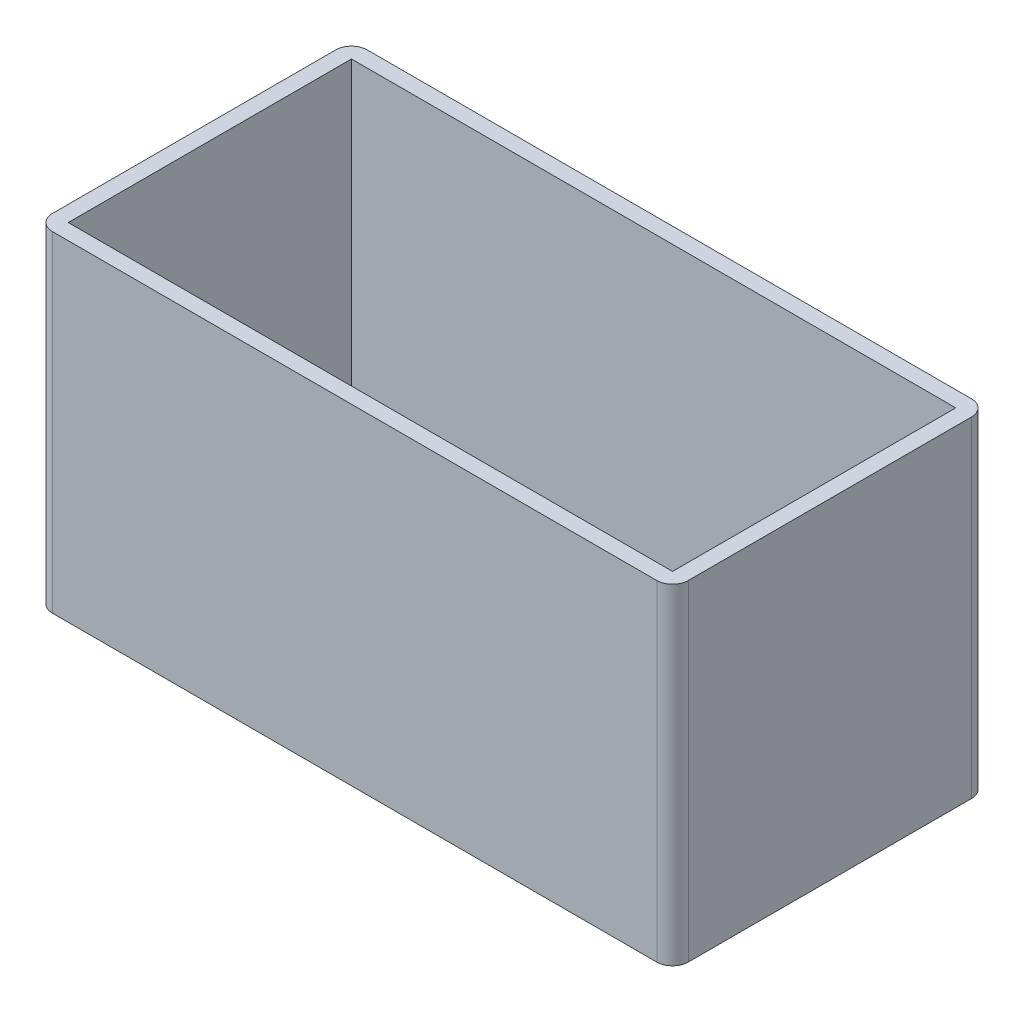
ISO-10303-21;
HEADER;
FILE_DESCRIPTION(('STEP AP214'),'2;1');
FILE_NAME('part.step','',(''),(''),'','','');
FILE_SCHEMA(('AUTOMOTIVE_DESIGN { 1 0 10303 214 1 1 1 1 }'));
ENDSEC;
DATA;
#1=APPLICATION_CONTEXT('core data for automotive mechanical design processes');
#2=APPLICATION_PROTOCOL_DEFINITION('international standard','automotive_design',2000,#1);
#3=PRODUCT_CONTEXT('',#1,'mechanical');
#4=PRODUCT('Part','Part','',(#3));
#5=PRODUCT_RELATED_PRODUCT_CATEGORY('part','',(#4));
#6=PRODUCT_DEFINITION_FORMATION('','',#4);
#7=PRODUCT_DEFINITION_CONTEXT('part definition',#1,'design');
#8=PRODUCT_DEFINITION('design','',#6,#7);
#9=PRODUCT_DEFINITION_SHAPE('','',#8);
#10=(LENGTH_UNIT() NAMED_UNIT(*) SI_UNIT(.MILLI.,.METRE.));
#11=(NAMED_UNIT(*) PLANE_ANGLE_UNIT() SI_UNIT($,.RADIAN.));
#12=(NAMED_UNIT(*) SI_UNIT($,.STERADIAN.) SOLID_ANGLE_UNIT());
#13=UNCERTAINTY_MEASURE_WITH_UNIT(LENGTH_MEASURE(1.E-05),#10,'distance_accuracy_value','');
#14=(GEOMETRIC_REPRESENTATION_CONTEXT(3) GLOBAL_UNCERTAINTY_ASSIGNED_CONTEXT((#13)) GLOBAL_UNIT_ASSIGNED_CONTEXT((#10,
#11,#12)) REPRESENTATION_CONTEXT('',''));
#15=CARTESIAN_POINT('',(0.,0.,0.));
#16=DIRECTION('',(0.,0.,1.));
#17=DIRECTION('',(1.,0.,0.));
#18=AXIS2_PLACEMENT_3D('',#15,#16,#17);
#19=CARTESIAN_POINT('',(0.,21.,0.));
#20=DIRECTION('',(0.,1.,0.));
#21=DIRECTION('',(0.,0.,1.));
#22=AXIS2_PLACEMENT_3D('',#19,#20,#21);
#23=PLANE('',#22);
#24=DIRECTION('',(-1.,0.,0.));
#25=VECTOR('',#24,1.);
#26=CARTESIAN_POINT('',(-28.9108910891089,21.,-10.));
#27=LINE('',#26,#25);
#28=CARTESIAN_POINT('',(10.4891089108911,21.,-10.));
#29=VERTEX_POINT('',#28);
#30=CARTESIAN_POINT('',(-27.9108910891089,21.,-10.));
#31=VERTEX_POINT('',#30);
#32=EDGE_CURVE('E171',#29,#31,#27,.T.);
#33=ORIENTED_EDGE('',*,*,#32,.T.);
#34=CARTESIAN_POINT('',(-27.9108910891089,21.,-9.));
#35=DIRECTION('',(0.,1.,0.));
#36=DIRECTION('',(0.,0.,1.));
#37=AXIS2_PLACEMENT_3D('',#34,#35,#36);
#38=CIRCLE('',#37,1.);
#39=CARTESIAN_POINT('',(-28.9108910891089,21.,-9.));
#40=VERTEX_POINT('',#39);
#41=EDGE_CURVE('E206',#31,#40,#38,.T.);
#42=ORIENTED_EDGE('',*,*,#41,.T.);
#43=DIRECTION('',(0.,0.,1.));
#44=VECTOR('',#43,1.);
#45=CARTESIAN_POINT('',(-28.9108910891089,21.,-10.));
#46=LINE('',#45,#44);
#47=CARTESIAN_POINT('',(-28.9108910891089,21.,9.));
#48=VERTEX_POINT('',#47);
#49=EDGE_CURVE('E163',#40,#48,#46,.T.);
#50=ORIENTED_EDGE('',*,*,#49,.T.);
#51=CARTESIAN_POINT('',(-27.9108910891089,21.,9.));
#52=DIRECTION('',(0.,1.,0.));
#53=DIRECTION('',(0.,0.,1.));
#54=AXIS2_PLACEMENT_3D('',#51,#52,#53);
#55=CIRCLE('',#54,1.);
#56=CARTESIAN_POINT('',(-27.9108910891089,21.,10.));
#57=VERTEX_POINT('',#56);
#58=EDGE_CURVE('E204',#48,#57,#55,.T.);
#59=ORIENTED_EDGE('',*,*,#58,.T.);
#60=DIRECTION('',(1.,0.,0.));
#61=VECTOR('',#60,1.);
#62=CARTESIAN_POINT('',(-28.9108910891089,21.,10.));
#63=LINE('',#62,#61);
#64=CARTESIAN_POINT('',(10.4891089108911,21.,10.));
#65=VERTEX_POINT('',#64);
#66=EDGE_CURVE('E166',#57,#65,#63,.T.);
#67=ORIENTED_EDGE('',*,*,#66,.T.);
#68=CARTESIAN_POINT('',(10.4891089108911,21.,9.));
#69=DIRECTION('',(0.,1.,0.));
#70=DIRECTION('',(0.,0.,1.));
#71=AXIS2_PLACEMENT_3D('',#68,#69,#70);
#72=CIRCLE('',#71,1.);
#73=CARTESIAN_POINT('',(11.4891089108911,21.,9.));
#74=VERTEX_POINT('',#73);
#75=EDGE_CURVE('E52',#65,#74,#72,.T.);
#76=ORIENTED_EDGE('',*,*,#75,.T.);
#77=DIRECTION('',(0.,0.,-1.));
#78=VECTOR('',#77,1.);
#79=CARTESIAN_POINT('',(11.4891089108911,21.,-10.));
#80=LINE('',#79,#78);
#81=CARTESIAN_POINT('',(11.4891089108911,21.,-9.));
#82=VERTEX_POINT('',#81);
#83=EDGE_CURVE('E169',#74,#82,#80,.T.);
#84=ORIENTED_EDGE('',*,*,#83,.T.);
#85=CARTESIAN_POINT('',(10.4891089108911,21.,-9.));
#86=DIRECTION('',(0.,1.,0.));
#87=DIRECTION('',(0.,0.,1.));
#88=AXIS2_PLACEMENT_3D('',#85,#86,#87);
#89=CIRCLE('',#88,1.);
#90=EDGE_CURVE('E202',#82,#29,#89,.T.);
#91=ORIENTED_EDGE('',*,*,#90,.T.);
#92=EDGE_LOOP('',(#33,#42,#50,#59,#67,#76,#84,#91));
#93=FACE_BOUND('',#92,.T.);
#94=DIRECTION('',(1.,0.,0.));
#95=VECTOR('',#94,1.);
#96=CARTESIAN_POINT('',(-27.9108910891089,21.,9.));
#97=LINE('',#96,#95);
#98=CARTESIAN_POINT('',(-27.9108910891089,21.,9.));
#99=VERTEX_POINT('',#98);
#100=CARTESIAN_POINT('',(10.4891089108911,21.,9.));
#101=VERTEX_POINT('',#100);
#102=EDGE_CURVE('E132',#99,#101,#97,.T.);
#103=ORIENTED_EDGE('',*,*,#102,.F.);
#104=DIRECTION('',(0.,0.,1.));
#105=VECTOR('',#104,1.);
#106=CARTESIAN_POINT('',(-27.9108910891089,21.,-9.));
#107=LINE('',#106,#105);
#108=CARTESIAN_POINT('',(-27.9108910891089,21.,-9.));
#109=VERTEX_POINT('',#108);
#110=EDGE_CURVE('E122',#109,#99,#107,.T.);
#111=ORIENTED_EDGE('',*,*,#110,.F.);
#112=DIRECTION('',(-1.,0.,0.));
#113=VECTOR('',#112,1.);
#114=CARTESIAN_POINT('',(-27.9108910891089,21.,-9.));
#115=LINE('',#114,#113);
#116=CARTESIAN_POINT('',(10.4891089108911,21.,-9.));
#117=VERTEX_POINT('',#116);
#118=EDGE_CURVE('E147',#117,#109,#115,.T.);
#119=ORIENTED_EDGE('',*,*,#118,.F.);
#120=DIRECTION('',(0.,0.,-1.));
#121=VECTOR('',#120,1.);
#122=CARTESIAN_POINT('',(10.4891089108911,21.,-9.));
#123=LINE('',#122,#121);
#124=EDGE_CURVE('E145',#101,#117,#123,.T.);
#125=ORIENTED_EDGE('',*,*,#124,.F.);
#126=EDGE_LOOP('',(#103,#111,#119,#125));
#127=FACE_BOUND('',#126,.T.);
#128=ADVANCED_FACE('F32',(#93,#127),#23,.T.);
#129=CARTESIAN_POINT('',(0.,0.,0.));
#130=DIRECTION('',(0.,1.,0.));
#131=DIRECTION('',(0.,0.,1.));
#132=AXIS2_PLACEMENT_3D('',#129,#130,#131);
#133=PLANE('',#132);
#134=DIRECTION('',(0.,0.,1.));
#135=VECTOR('',#134,1.);
#136=CARTESIAN_POINT('',(-28.9108910891089,0.,-10.));
#137=LINE('',#136,#135);
#138=CARTESIAN_POINT('',(-28.9108910891089,0.,-9.));
#139=VERTEX_POINT('',#138);
#140=CARTESIAN_POINT('',(-28.9108910891089,0.,9.));
#141=VERTEX_POINT('',#140);
#142=EDGE_CURVE('E140',#139,#141,#137,.T.);
#143=ORIENTED_EDGE('',*,*,#142,.F.);
#144=CARTESIAN_POINT('',(-27.9108910891089,0.,-9.));
#145=DIRECTION('',(0.,1.,0.));
#146=DIRECTION('',(0.,0.,1.));
#147=AXIS2_PLACEMENT_3D('',#144,#145,#146);
#148=CIRCLE('',#147,1.);
#149=CARTESIAN_POINT('',(-27.9108910891089,0.,-10.));
#150=VERTEX_POINT('',#149);
#151=EDGE_CURVE('E194',#139,#150,#148,.F.);
#152=ORIENTED_EDGE('',*,*,#151,.T.);
#153=DIRECTION('',(-1.,0.,0.));
#154=VECTOR('',#153,1.);
#155=CARTESIAN_POINT('',(-28.9108910891089,0.,-10.));
#156=LINE('',#155,#154);
#157=CARTESIAN_POINT('',(10.4891089108911,0.,-10.));
#158=VERTEX_POINT('',#157);
#159=EDGE_CURVE('E167',#158,#150,#156,.T.);
#160=ORIENTED_EDGE('',*,*,#159,.F.);
#161=CARTESIAN_POINT('',(10.4891089108911,0.,-9.));
#162=DIRECTION('',(0.,1.,0.));
#163=DIRECTION('',(0.,0.,1.));
#164=AXIS2_PLACEMENT_3D('',#161,#162,#163);
#165=CIRCLE('',#164,1.);
#166=CARTESIAN_POINT('',(11.4891089108911,0.,-9.));
#167=VERTEX_POINT('',#166);
#168=EDGE_CURVE('E190',#158,#167,#165,.F.);
#169=ORIENTED_EDGE('',*,*,#168,.T.);
#170=DIRECTION('',(0.,0.,-1.));
#171=VECTOR('',#170,1.);
#172=CARTESIAN_POINT('',(11.4891089108911,0.,-10.));
#173=LINE('',#172,#171);
#174=CARTESIAN_POINT('',(11.4891089108911,0.,9.));
#175=VERTEX_POINT('',#174);
#176=EDGE_CURVE('E180',#175,#167,#173,.T.);
#177=ORIENTED_EDGE('',*,*,#176,.F.);
#178=CARTESIAN_POINT('',(10.4891089108911,0.,9.));
#179=DIRECTION('',(0.,1.,0.));
#180=DIRECTION('',(0.,0.,1.));
#181=AXIS2_PLACEMENT_3D('',#178,#179,#180);
#182=CIRCLE('',#181,1.);
#183=CARTESIAN_POINT('',(10.4891089108911,0.,10.));
#184=VERTEX_POINT('',#183);
#185=EDGE_CURVE('E188',#175,#184,#182,.F.);
#186=ORIENTED_EDGE('',*,*,#185,.T.);
#187=DIRECTION('',(1.,0.,0.));
#188=VECTOR('',#187,1.);
#189=CARTESIAN_POINT('',(-28.9108910891089,0.,10.));
#190=LINE('',#189,#188);
#191=CARTESIAN_POINT('',(-27.9108910891089,0.,10.));
#192=VERTEX_POINT('',#191);
#193=EDGE_CURVE('E177',#192,#184,#190,.T.);
#194=ORIENTED_EDGE('',*,*,#193,.F.);
#195=CARTESIAN_POINT('',(-27.9108910891089,0.,9.));
#196=DIRECTION('',(0.,1.,0.));
#197=DIRECTION('',(0.,0.,1.));
#198=AXIS2_PLACEMENT_3D('',#195,#196,#197);
#199=CIRCLE('',#198,1.);
#200=EDGE_CURVE('E192',#192,#141,#199,.F.);
#201=ORIENTED_EDGE('',*,*,#200,.T.);
#202=EDGE_LOOP('',(#143,#152,#160,#169,#177,#186,#194,#201));
#203=FACE_BOUND('',#202,.T.);
#204=DIRECTION('',(0.,0.,1.));
#205=VECTOR('',#204,1.);
#206=CARTESIAN_POINT('',(-27.9108910891089,0.,-9.));
#207=LINE('',#206,#205);
#208=CARTESIAN_POINT('',(-27.9108910891089,0.,-9.));
#209=VERTEX_POINT('',#208);
#210=CARTESIAN_POINT('',(-27.9108910891089,0.,9.));
#211=VERTEX_POINT('',#210);
#212=EDGE_CURVE('E151',#209,#211,#207,.T.);
#213=ORIENTED_EDGE('',*,*,#212,.T.);
#214=DIRECTION('',(1.,0.,0.));
#215=VECTOR('',#214,1.);
#216=CARTESIAN_POINT('',(-27.9108910891089,0.,9.));
#217=LINE('',#216,#215);
#218=CARTESIAN_POINT('',(10.4891089108911,0.,9.));
#219=VERTEX_POINT('',#218);
#220=EDGE_CURVE('E139',#211,#219,#217,.T.);
#221=ORIENTED_EDGE('',*,*,#220,.T.);
#222=DIRECTION('',(0.,0.,-1.));
#223=VECTOR('',#222,1.);
#224=CARTESIAN_POINT('',(10.4891089108911,0.,-9.));
#225=LINE('',#224,#223);
#226=CARTESIAN_POINT('',(10.4891089108911,0.,-9.));
#227=VERTEX_POINT('',#226);
#228=EDGE_CURVE('E154',#219,#227,#225,.T.);
#229=ORIENTED_EDGE('',*,*,#228,.T.);
#230=DIRECTION('',(-1.,0.,0.));
#231=VECTOR('',#230,1.);
#232=CARTESIAN_POINT('',(-27.9108910891089,0.,-9.));
#233=LINE('',#232,#231);
#234=EDGE_CURVE('E133',#227,#209,#233,.T.);
#235=ORIENTED_EDGE('',*,*,#234,.T.);
#236=EDGE_LOOP('',(#213,#221,#229,#235));
#237=FACE_BOUND('',#236,.T.);
#238=ADVANCED_FACE('F219',(#203,#237),#133,.F.);
#239=CARTESIAN_POINT('',(-28.9108910891089,21.,-10.));
#240=DIRECTION('',(1.,0.,0.));
#241=DIRECTION('',(0.,0.,-1.));
#242=AXIS2_PLACEMENT_3D('',#239,#240,#241);
#243=PLANE('',#242);
#244=ORIENTED_EDGE('',*,*,#49,.F.);
#245=DIRECTION('',(0.,-1.,0.));
#246=VECTOR('',#245,1.);
#247=CARTESIAN_POINT('',(-28.9108910891089,21.,-9.));
#248=LINE('',#247,#246);
#249=EDGE_CURVE('E185',#40,#139,#248,.T.);
#250=ORIENTED_EDGE('',*,*,#249,.T.);
#251=ORIENTED_EDGE('',*,*,#142,.T.);
#252=DIRECTION('',(0.,-1.,0.));
#253=VECTOR('',#252,1.);
#254=CARTESIAN_POINT('',(-28.9108910891089,21.,9.));
#255=LINE('',#254,#253);
#256=EDGE_CURVE('E174',#141,#48,#255,.F.);
#257=ORIENTED_EDGE('',*,*,#256,.T.);
#258=EDGE_LOOP('',(#244,#250,#251,#257));
#259=FACE_BOUND('',#258,.T.);
#260=ADVANCED_FACE('F237',(#259),#243,.F.);
#261=CARTESIAN_POINT('',(-28.9108910891089,21.,10.));
#262=DIRECTION('',(0.,0.,-1.));
#263=DIRECTION('',(-1.,0.,0.));
#264=AXIS2_PLACEMENT_3D('',#261,#262,#263);
#265=PLANE('',#264);
#266=ORIENTED_EDGE('',*,*,#66,.F.);
#267=DIRECTION('',(0.,-1.,0.));
#268=VECTOR('',#267,1.);
#269=CARTESIAN_POINT('',(-27.9108910891089,21.,10.));
#270=LINE('',#269,#268);
#271=EDGE_CURVE('E210',#57,#192,#270,.T.);
#272=ORIENTED_EDGE('',*,*,#271,.T.);
#273=ORIENTED_EDGE('',*,*,#193,.T.);
#274=DIRECTION('',(0.,-1.,0.));
#275=VECTOR('',#274,1.);
#276=CARTESIAN_POINT('',(10.4891089108911,21.,10.));
#277=LINE('',#276,#275);
#278=EDGE_CURVE('E208',#184,#65,#277,.F.);
#279=ORIENTED_EDGE('',*,*,#278,.T.);
#280=EDGE_LOOP('',(#266,#272,#273,#279));
#281=FACE_BOUND('',#280,.T.);
#282=ADVANCED_FACE('F245',(#281),#265,.F.);
#283=CARTESIAN_POINT('',(11.4891089108911,21.,-10.));
#284=DIRECTION('',(-1.,0.,0.));
#285=DIRECTION('',(0.,0.,1.));
#286=AXIS2_PLACEMENT_3D('',#283,#284,#285);
#287=PLANE('',#286);
#288=ORIENTED_EDGE('',*,*,#176,.T.);
#289=DIRECTION('',(0.,-1.,0.));
#290=VECTOR('',#289,1.);
#291=CARTESIAN_POINT('',(11.4891089108911,21.,-9.));
#292=LINE('',#291,#290);
#293=EDGE_CURVE('E11',#167,#82,#292,.F.);
#294=ORIENTED_EDGE('',*,*,#293,.T.);
#295=ORIENTED_EDGE('',*,*,#83,.F.);
#296=DIRECTION('',(0.,-1.,0.));
#297=VECTOR('',#296,1.);
#298=CARTESIAN_POINT('',(11.4891089108911,21.,9.));
#299=LINE('',#298,#297);
#300=EDGE_CURVE('E40',#74,#175,#299,.T.);
#301=ORIENTED_EDGE('',*,*,#300,.T.);
#302=EDGE_LOOP('',(#288,#294,#295,#301));
#303=FACE_BOUND('',#302,.T.);
#304=ADVANCED_FACE('F215',(#303),#287,.F.);
#305=CARTESIAN_POINT('',(-28.9108910891089,21.,-10.));
#306=DIRECTION('',(0.,0.,1.));
#307=DIRECTION('',(1.,0.,0.));
#308=AXIS2_PLACEMENT_3D('',#305,#306,#307);
#309=PLANE('',#308);
#310=ORIENTED_EDGE('',*,*,#159,.T.);
#311=DIRECTION('',(0.,-1.,0.));
#312=VECTOR('',#311,1.);
#313=CARTESIAN_POINT('',(-27.9108910891089,21.,-10.));
#314=LINE('',#313,#312);
#315=EDGE_CURVE('E199',#150,#31,#314,.F.);
#316=ORIENTED_EDGE('',*,*,#315,.T.);
#317=ORIENTED_EDGE('',*,*,#32,.F.);
#318=DIRECTION('',(0.,-1.,0.));
#319=VECTOR('',#318,1.);
#320=CARTESIAN_POINT('',(10.4891089108911,21.,-10.));
#321=LINE('',#320,#319);
#322=EDGE_CURVE('E196',#29,#158,#321,.T.);
#323=ORIENTED_EDGE('',*,*,#322,.T.);
#324=EDGE_LOOP('',(#310,#316,#317,#323));
#325=FACE_BOUND('',#324,.T.);
#326=ADVANCED_FACE('F229',(#325),#309,.F.);
#327=CARTESIAN_POINT('',(-27.9108910891089,21.,-9.));
#328=DIRECTION('',(1.,0.,0.));
#329=DIRECTION('',(0.,0.,-1.));
#330=AXIS2_PLACEMENT_3D('',#327,#328,#329);
#331=PLANE('',#330);
#332=ORIENTED_EDGE('',*,*,#212,.F.);
#333=DIRECTION('',(0.,-1.,0.));
#334=VECTOR('',#333,1.);
#335=CARTESIAN_POINT('',(-27.9108910891089,21.,-9.));
#336=LINE('',#335,#334);
#337=EDGE_CURVE('E128',#109,#209,#336,.T.);
#338=ORIENTED_EDGE('',*,*,#337,.F.);
#339=ORIENTED_EDGE('',*,*,#110,.T.);
#340=DIRECTION('',(0.,-1.,0.));
#341=VECTOR('',#340,1.);
#342=CARTESIAN_POINT('',(-27.9108910891089,21.,9.));
#343=LINE('',#342,#341);
#344=EDGE_CURVE('E125',#99,#211,#343,.T.);
#345=ORIENTED_EDGE('',*,*,#344,.T.);
#346=EDGE_LOOP('',(#332,#338,#339,#345));
#347=FACE_BOUND('',#346,.T.);
#348=ADVANCED_FACE('F124',(#347),#331,.T.);
#349=CARTESIAN_POINT('',(-27.9108910891089,21.,9.));
#350=DIRECTION('',(0.,0.,-1.));
#351=DIRECTION('',(-1.,0.,0.));
#352=AXIS2_PLACEMENT_3D('',#349,#350,#351);
#353=PLANE('',#352);
#354=ORIENTED_EDGE('',*,*,#220,.F.);
#355=ORIENTED_EDGE('',*,*,#344,.F.);
#356=ORIENTED_EDGE('',*,*,#102,.T.);
#357=DIRECTION('',(0.,-1.,0.));
#358=VECTOR('',#357,1.);
#359=CARTESIAN_POINT('',(10.4891089108911,21.,9.));
#360=LINE('',#359,#358);
#361=EDGE_CURVE('E141',#101,#219,#360,.T.);
#362=ORIENTED_EDGE('',*,*,#361,.T.);
#363=EDGE_LOOP('',(#354,#355,#356,#362));
#364=FACE_BOUND('',#363,.T.);
#365=ADVANCED_FACE('F136',(#364),#353,.T.);
#366=CARTESIAN_POINT('',(10.4891089108911,21.,-9.));
#367=DIRECTION('',(-1.,0.,0.));
#368=DIRECTION('',(0.,0.,1.));
#369=AXIS2_PLACEMENT_3D('',#366,#367,#368);
#370=PLANE('',#369);
#371=ORIENTED_EDGE('',*,*,#228,.F.);
#372=ORIENTED_EDGE('',*,*,#361,.F.);
#373=ORIENTED_EDGE('',*,*,#124,.T.);
#374=DIRECTION('',(0.,-1.,0.));
#375=VECTOR('',#374,1.);
#376=CARTESIAN_POINT('',(10.4891089108911,21.,-9.));
#377=LINE('',#376,#375);
#378=EDGE_CURVE('E160',#117,#227,#377,.T.);
#379=ORIENTED_EDGE('',*,*,#378,.T.);
#380=EDGE_LOOP('',(#371,#372,#373,#379));
#381=FACE_BOUND('',#380,.T.);
#382=ADVANCED_FACE('F301',(#381),#370,.T.);
#383=CARTESIAN_POINT('',(-27.9108910891089,21.,-9.));
#384=DIRECTION('',(0.,0.,1.));
#385=DIRECTION('',(1.,0.,0.));
#386=AXIS2_PLACEMENT_3D('',#383,#384,#385);
#387=PLANE('',#386);
#388=ORIENTED_EDGE('',*,*,#234,.F.);
#389=ORIENTED_EDGE('',*,*,#378,.F.);
#390=ORIENTED_EDGE('',*,*,#118,.T.);
#391=ORIENTED_EDGE('',*,*,#337,.T.);
#392=EDGE_LOOP('',(#388,#389,#390,#391));
#393=FACE_BOUND('',#392,.T.);
#394=ADVANCED_FACE('F270',(#393),#387,.T.);
#395=CARTESIAN_POINT('',(-27.9108910891089,21.,-9.));
#396=DIRECTION('',(0.,-1.,0.));
#397=DIRECTION('',(0.,0.,-1.));
#398=AXIS2_PLACEMENT_3D('',#395,#396,#397);
#399=CYLINDRICAL_SURFACE('',#398,1.);
#400=ORIENTED_EDGE('',*,*,#41,.F.);
#401=ORIENTED_EDGE('',*,*,#315,.F.);
#402=ORIENTED_EDGE('',*,*,#151,.F.);
#403=ORIENTED_EDGE('',*,*,#249,.F.);
#404=EDGE_LOOP('',(#400,#401,#402,#403));
#405=FACE_BOUND('',#404,.T.);
#406=ADVANCED_FACE('F235',(#405),#399,.T.);
#407=CARTESIAN_POINT('',(-27.9108910891089,21.,9.));
#408=DIRECTION('',(0.,-1.,0.));
#409=DIRECTION('',(0.,0.,-1.));
#410=AXIS2_PLACEMENT_3D('',#407,#408,#409);
#411=CYLINDRICAL_SURFACE('',#410,1.);
#412=ORIENTED_EDGE('',*,*,#58,.F.);
#413=ORIENTED_EDGE('',*,*,#256,.F.);
#414=ORIENTED_EDGE('',*,*,#200,.F.);
#415=ORIENTED_EDGE('',*,*,#271,.F.);
#416=EDGE_LOOP('',(#412,#413,#414,#415));
#417=FACE_BOUND('',#416,.T.);
#418=ADVANCED_FACE('F242',(#417),#411,.T.);
#419=CARTESIAN_POINT('',(10.4891089108911,21.,-9.));
#420=DIRECTION('',(0.,-1.,0.));
#421=DIRECTION('',(0.,0.,-1.));
#422=AXIS2_PLACEMENT_3D('',#419,#420,#421);
#423=CYLINDRICAL_SURFACE('',#422,1.);
#424=ORIENTED_EDGE('',*,*,#90,.F.);
#425=ORIENTED_EDGE('',*,*,#293,.F.);
#426=ORIENTED_EDGE('',*,*,#168,.F.);
#427=ORIENTED_EDGE('',*,*,#322,.F.);
#428=EDGE_LOOP('',(#424,#425,#426,#427));
#429=FACE_BOUND('',#428,.T.);
#430=ADVANCED_FACE('F226',(#429),#423,.T.);
#431=CARTESIAN_POINT('',(10.4891089108911,21.,9.));
#432=DIRECTION('',(0.,-1.,0.));
#433=DIRECTION('',(0.,0.,-1.));
#434=AXIS2_PLACEMENT_3D('',#431,#432,#433);
#435=CYLINDRICAL_SURFACE('',#434,1.);
#436=ORIENTED_EDGE('',*,*,#75,.F.);
#437=ORIENTED_EDGE('',*,*,#278,.F.);
#438=ORIENTED_EDGE('',*,*,#185,.F.);
#439=ORIENTED_EDGE('',*,*,#300,.F.);
#440=EDGE_LOOP('',(#436,#437,#438,#439));
#441=FACE_BOUND('',#440,.T.);
#442=ADVANCED_FACE('F34',(#441),#435,.T.);
#443=CLOSED_SHELL('',(#128,#238,#260,#282,#304,#326,#348,#365,#382,#394,#406,#418,#430,#442));
#444=MANIFOLD_SOLID_BREP('B2',#443);
#445=ADVANCED_BREP_SHAPE_REPRESENTATION('',(#18,#444),#14);
#446=SHAPE_DEFINITION_REPRESENTATION(#9,#445);
ENDSEC;
END-ISO-10303-21;
